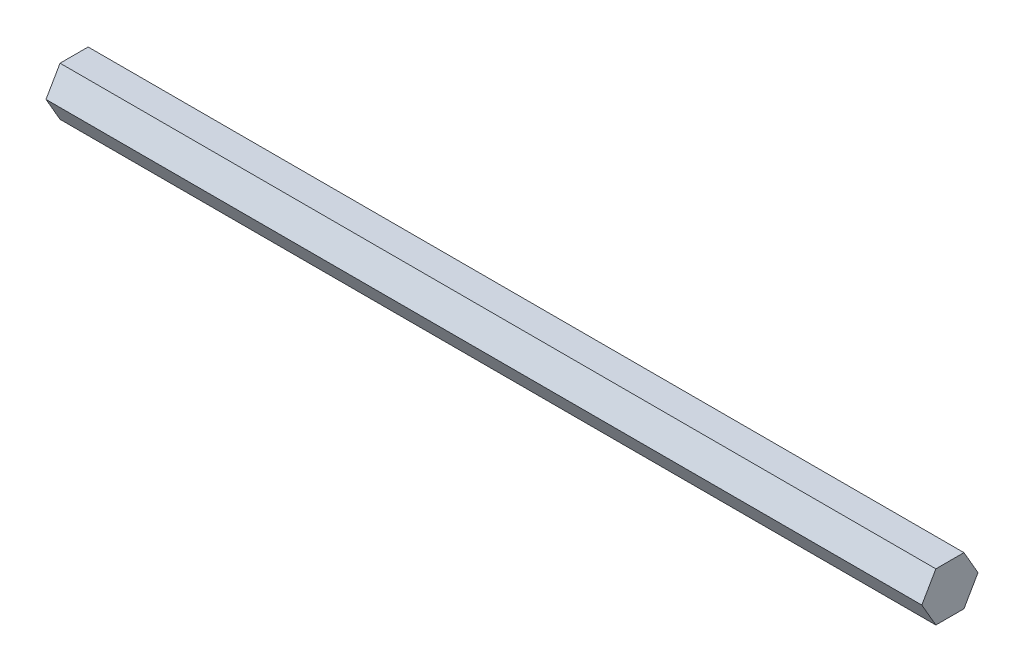
ISO-10303-21;
HEADER;
FILE_DESCRIPTION(('STEP AP214'),'2;1');
FILE_NAME('part.step','',(''),(''),'','','');
FILE_SCHEMA(('AUTOMOTIVE_DESIGN { 1 0 10303 214 1 1 1 1 }'));
ENDSEC;
DATA;
#1=APPLICATION_CONTEXT('core data for automotive mechanical design processes');
#2=APPLICATION_PROTOCOL_DEFINITION('international standard','automotive_design',2000,#1);
#3=PRODUCT_CONTEXT('',#1,'mechanical');
#4=PRODUCT('Part','Part','',(#3));
#5=PRODUCT_RELATED_PRODUCT_CATEGORY('part','',(#4));
#6=PRODUCT_DEFINITION_FORMATION('','',#4);
#7=PRODUCT_DEFINITION_CONTEXT('part definition',#1,'design');
#8=PRODUCT_DEFINITION('design','',#6,#7);
#9=PRODUCT_DEFINITION_SHAPE('','',#8);
#10=(LENGTH_UNIT() NAMED_UNIT(*) SI_UNIT(.MILLI.,.METRE.));
#11=(NAMED_UNIT(*) PLANE_ANGLE_UNIT() SI_UNIT($,.RADIAN.));
#12=(NAMED_UNIT(*) SI_UNIT($,.STERADIAN.) SOLID_ANGLE_UNIT());
#13=UNCERTAINTY_MEASURE_WITH_UNIT(LENGTH_MEASURE(1.E-05),#10,'distance_accuracy_value','');
#14=(GEOMETRIC_REPRESENTATION_CONTEXT(3) GLOBAL_UNCERTAINTY_ASSIGNED_CONTEXT((#13)) GLOBAL_UNIT_ASSIGNED_CONTEXT((#10,
#11,#12)) REPRESENTATION_CONTEXT('',''));
#15=CARTESIAN_POINT('',(0.,0.,0.));
#16=DIRECTION('',(0.,0.,1.));
#17=DIRECTION('',(1.,0.,0.));
#18=AXIS2_PLACEMENT_3D('',#15,#16,#17);
#19=CARTESIAN_POINT('',(228.6,-6.35000000000001,-3.66617420935412));
#20=DIRECTION('',(0.,0.5,0.866025403784439));
#21=DIRECTION('',(0.,-0.866025403784439,0.5));
#22=AXIS2_PLACEMENT_3D('',#19,#20,#21);
#23=PLANE('',#22);
#24=DIRECTION('',(0.,0.866025403784439,-0.5));
#25=VECTOR('',#24,1.);
#26=CARTESIAN_POINT('',(0.,-6.35000000000001,-3.66617420935412));
#27=LINE('',#26,#25);
#28=CARTESIAN_POINT('',(0.,-6.35000000000001,-3.66617420935412));
#29=VERTEX_POINT('',#28);
#30=CARTESIAN_POINT('',(0.,0.,-7.33234841870825));
#31=VERTEX_POINT('',#30);
#32=EDGE_CURVE('E128',#29,#31,#27,.T.);
#33=ORIENTED_EDGE('',*,*,#32,.T.);
#34=DIRECTION('',(-1.,0.,0.));
#35=VECTOR('',#34,1.);
#36=CARTESIAN_POINT('',(228.6,0.,-7.33234841870825));
#37=LINE('',#36,#35);
#38=CARTESIAN_POINT('',(228.6,0.,-7.33234841870825));
#39=VERTEX_POINT('',#38);
#40=EDGE_CURVE('E11',#39,#31,#37,.T.);
#41=ORIENTED_EDGE('',*,*,#40,.F.);
#42=DIRECTION('',(0.,0.866025403784439,-0.5));
#43=VECTOR('',#42,1.);
#44=CARTESIAN_POINT('',(228.6,-6.35000000000001,-3.66617420935412));
#45=LINE('',#44,#43);
#46=CARTESIAN_POINT('',(228.6,-6.35000000000001,-3.66617420935412));
#47=VERTEX_POINT('',#46);
#48=EDGE_CURVE('E144',#47,#39,#45,.T.);
#49=ORIENTED_EDGE('',*,*,#48,.F.);
#50=DIRECTION('',(-1.,0.,0.));
#51=VECTOR('',#50,1.);
#52=CARTESIAN_POINT('',(228.6,-6.35000000000001,-3.66617420935412));
#53=LINE('',#52,#51);
#54=EDGE_CURVE('E124',#47,#29,#53,.T.);
#55=ORIENTED_EDGE('',*,*,#54,.T.);
#56=EDGE_LOOP('',(#33,#41,#49,#55));
#57=FACE_BOUND('',#56,.T.);
#58=ADVANCED_FACE('F39',(#57),#23,.F.);
#59=CARTESIAN_POINT('',(228.6,0.,-7.33234841870825));
#60=DIRECTION('',(0.,-0.5,0.866025403784439));
#61=DIRECTION('',(0.,-0.866025403784439,-0.5));
#62=AXIS2_PLACEMENT_3D('',#59,#60,#61);
#63=PLANE('',#62);
#64=DIRECTION('',(0.,0.866025403784439,0.5));
#65=VECTOR('',#64,1.);
#66=CARTESIAN_POINT('',(0.,0.,-7.33234841870825));
#67=LINE('',#66,#65);
#68=CARTESIAN_POINT('',(0.,6.35000000000001,-3.66617420935412));
#69=VERTEX_POINT('',#68);
#70=EDGE_CURVE('E132',#31,#69,#67,.T.);
#71=ORIENTED_EDGE('',*,*,#70,.T.);
#72=DIRECTION('',(-1.,0.,0.));
#73=VECTOR('',#72,1.);
#74=CARTESIAN_POINT('',(228.6,6.35000000000001,-3.66617420935412));
#75=LINE('',#74,#73);
#76=CARTESIAN_POINT('',(228.6,6.35000000000001,-3.66617420935412));
#77=VERTEX_POINT('',#76);
#78=EDGE_CURVE('E48',#77,#69,#75,.T.);
#79=ORIENTED_EDGE('',*,*,#78,.F.);
#80=DIRECTION('',(0.,0.866025403784439,0.5));
#81=VECTOR('',#80,1.);
#82=CARTESIAN_POINT('',(228.6,0.,-7.33234841870825));
#83=LINE('',#82,#81);
#84=EDGE_CURVE('E93',#39,#77,#83,.T.);
#85=ORIENTED_EDGE('',*,*,#84,.F.);
#86=ORIENTED_EDGE('',*,*,#40,.T.);
#87=EDGE_LOOP('',(#71,#79,#85,#86));
#88=FACE_BOUND('',#87,.T.);
#89=ADVANCED_FACE('F172',(#88),#63,.F.);
#90=CARTESIAN_POINT('',(228.6,6.35000000000001,-3.66617420935412));
#91=DIRECTION('',(0.,-1.,0.));
#92=DIRECTION('',(0.,0.,-1.));
#93=AXIS2_PLACEMENT_3D('',#90,#91,#92);
#94=PLANE('',#93);
#95=DIRECTION('',(0.,0.,1.));
#96=VECTOR('',#95,1.);
#97=CARTESIAN_POINT('',(0.,6.35000000000001,-3.66617420935412));
#98=LINE('',#97,#96);
#99=CARTESIAN_POINT('',(0.,6.35000000000001,3.66617420935413));
#100=VERTEX_POINT('',#99);
#101=EDGE_CURVE('E135',#69,#100,#98,.T.);
#102=ORIENTED_EDGE('',*,*,#101,.T.);
#103=DIRECTION('',(-1.,0.,0.));
#104=VECTOR('',#103,1.);
#105=CARTESIAN_POINT('',(228.6,6.35000000000001,3.66617420935413));
#106=LINE('',#105,#104);
#107=CARTESIAN_POINT('',(228.6,6.35000000000001,3.66617420935413));
#108=VERTEX_POINT('',#107);
#109=EDGE_CURVE('E117',#108,#100,#106,.T.);
#110=ORIENTED_EDGE('',*,*,#109,.F.);
#111=DIRECTION('',(0.,0.,1.));
#112=VECTOR('',#111,1.);
#113=CARTESIAN_POINT('',(228.6,6.35000000000001,-3.66617420935412));
#114=LINE('',#113,#112);
#115=EDGE_CURVE('E106',#77,#108,#114,.T.);
#116=ORIENTED_EDGE('',*,*,#115,.F.);
#117=ORIENTED_EDGE('',*,*,#78,.T.);
#118=EDGE_LOOP('',(#102,#110,#116,#117));
#119=FACE_BOUND('',#118,.T.);
#120=ADVANCED_FACE('F154',(#119),#94,.F.);
#121=CARTESIAN_POINT('',(228.6,6.35000000000001,3.66617420935413));
#122=DIRECTION('',(0.,-0.5,-0.866025403784439));
#123=DIRECTION('',(0.,0.866025403784439,-0.5));
#124=AXIS2_PLACEMENT_3D('',#121,#122,#123);
#125=PLANE('',#124);
#126=DIRECTION('',(0.,-0.866025403784439,0.5));
#127=VECTOR('',#126,1.);
#128=CARTESIAN_POINT('',(0.,6.35000000000001,3.66617420935413));
#129=LINE('',#128,#127);
#130=CARTESIAN_POINT('',(0.,0.,7.33234841870826));
#131=VERTEX_POINT('',#130);
#132=EDGE_CURVE('E115',#100,#131,#129,.T.);
#133=ORIENTED_EDGE('',*,*,#132,.T.);
#134=DIRECTION('',(-1.,0.,0.));
#135=VECTOR('',#134,1.);
#136=CARTESIAN_POINT('',(228.6,0.,7.33234841870826));
#137=LINE('',#136,#135);
#138=CARTESIAN_POINT('',(228.6,0.,7.33234841870826));
#139=VERTEX_POINT('',#138);
#140=EDGE_CURVE('E112',#139,#131,#137,.T.);
#141=ORIENTED_EDGE('',*,*,#140,.F.);
#142=DIRECTION('',(0.,-0.866025403784439,0.5));
#143=VECTOR('',#142,1.);
#144=CARTESIAN_POINT('',(228.6,6.35000000000001,3.66617420935413));
#145=LINE('',#144,#143);
#146=EDGE_CURVE('E100',#108,#139,#145,.T.);
#147=ORIENTED_EDGE('',*,*,#146,.F.);
#148=ORIENTED_EDGE('',*,*,#109,.T.);
#149=EDGE_LOOP('',(#133,#141,#147,#148));
#150=FACE_BOUND('',#149,.T.);
#151=ADVANCED_FACE('F113',(#150),#125,.F.);
#152=CARTESIAN_POINT('',(228.6,0.,7.33234841870826));
#153=DIRECTION('',(0.,0.5,-0.866025403784439));
#154=DIRECTION('',(0.,0.866025403784439,0.5));
#155=AXIS2_PLACEMENT_3D('',#152,#153,#154);
#156=PLANE('',#155);
#157=DIRECTION('',(0.,-0.866025403784439,-0.5));
#158=VECTOR('',#157,1.);
#159=CARTESIAN_POINT('',(0.,0.,7.33234841870826));
#160=LINE('',#159,#158);
#161=CARTESIAN_POINT('',(0.,-6.35000000000001,3.66617420935413));
#162=VERTEX_POINT('',#161);
#163=EDGE_CURVE('E79',#131,#162,#160,.T.);
#164=ORIENTED_EDGE('',*,*,#163,.T.);
#165=DIRECTION('',(-1.,0.,0.));
#166=VECTOR('',#165,1.);
#167=CARTESIAN_POINT('',(228.6,-6.35000000000001,3.66617420935413));
#168=LINE('',#167,#166);
#169=CARTESIAN_POINT('',(228.6,-6.35000000000001,3.66617420935413));
#170=VERTEX_POINT('',#169);
#171=EDGE_CURVE('E118',#170,#162,#168,.T.);
#172=ORIENTED_EDGE('',*,*,#171,.F.);
#173=DIRECTION('',(0.,-0.866025403784439,-0.5));
#174=VECTOR('',#173,1.);
#175=CARTESIAN_POINT('',(228.6,0.,7.33234841870826));
#176=LINE('',#175,#174);
#177=EDGE_CURVE('E104',#139,#170,#176,.T.);
#178=ORIENTED_EDGE('',*,*,#177,.F.);
#179=ORIENTED_EDGE('',*,*,#140,.T.);
#180=EDGE_LOOP('',(#164,#172,#178,#179));
#181=FACE_BOUND('',#180,.T.);
#182=ADVANCED_FACE('F120',(#181),#156,.F.);
#183=CARTESIAN_POINT('',(228.6,-6.35000000000001,3.66617420935413));
#184=DIRECTION('',(0.,1.,0.));
#185=DIRECTION('',(0.,0.,1.));
#186=AXIS2_PLACEMENT_3D('',#183,#184,#185);
#187=PLANE('',#186);
#188=DIRECTION('',(0.,0.,-1.));
#189=VECTOR('',#188,1.);
#190=CARTESIAN_POINT('',(0.,-6.35000000000001,3.66617420935413));
#191=LINE('',#190,#189);
#192=EDGE_CURVE('E85',#162,#29,#191,.T.);
#193=ORIENTED_EDGE('',*,*,#192,.T.);
#194=ORIENTED_EDGE('',*,*,#54,.F.);
#195=DIRECTION('',(0.,0.,-1.));
#196=VECTOR('',#195,1.);
#197=CARTESIAN_POINT('',(228.6,-6.35000000000001,3.66617420935413));
#198=LINE('',#197,#196);
#199=EDGE_CURVE('E56',#170,#47,#198,.T.);
#200=ORIENTED_EDGE('',*,*,#199,.F.);
#201=ORIENTED_EDGE('',*,*,#171,.T.);
#202=EDGE_LOOP('',(#193,#194,#200,#201));
#203=FACE_BOUND('',#202,.T.);
#204=ADVANCED_FACE('F161',(#203),#187,.F.);
#205=CARTESIAN_POINT('',(228.6,0.,0.));
#206=DIRECTION('',(1.,0.,0.));
#207=DIRECTION('',(0.,0.,-1.));
#208=AXIS2_PLACEMENT_3D('',#205,#206,#207);
#209=PLANE('',#208);
#210=ORIENTED_EDGE('',*,*,#48,.T.);
#211=ORIENTED_EDGE('',*,*,#84,.T.);
#212=ORIENTED_EDGE('',*,*,#115,.T.);
#213=ORIENTED_EDGE('',*,*,#146,.T.);
#214=ORIENTED_EDGE('',*,*,#177,.T.);
#215=ORIENTED_EDGE('',*,*,#199,.T.);
#216=EDGE_LOOP('',(#210,#211,#212,#213,#214,#215));
#217=FACE_BOUND('',#216,.T.);
#218=ADVANCED_FACE('F102',(#217),#209,.T.);
#219=CARTESIAN_POINT('',(0.,0.,0.));
#220=DIRECTION('',(1.,0.,0.));
#221=DIRECTION('',(0.,0.,-1.));
#222=AXIS2_PLACEMENT_3D('',#219,#220,#221);
#223=PLANE('',#222);
#224=ORIENTED_EDGE('',*,*,#32,.F.);
#225=ORIENTED_EDGE('',*,*,#192,.F.);
#226=ORIENTED_EDGE('',*,*,#163,.F.);
#227=ORIENTED_EDGE('',*,*,#132,.F.);
#228=ORIENTED_EDGE('',*,*,#101,.F.);
#229=ORIENTED_EDGE('',*,*,#70,.F.);
#230=EDGE_LOOP('',(#224,#225,#226,#227,#228,#229));
#231=FACE_BOUND('',#230,.T.);
#232=ADVANCED_FACE('F157',(#231),#223,.F.);
#233=CLOSED_SHELL('',(#58,#89,#120,#151,#182,#204,#218,#232));
#234=MANIFOLD_SOLID_BREP('B2',#233);
#235=ADVANCED_BREP_SHAPE_REPRESENTATION('',(#18,#234),#14);
#236=SHAPE_DEFINITION_REPRESENTATION(#9,#235);
ENDSEC;
END-ISO-10303-21;
